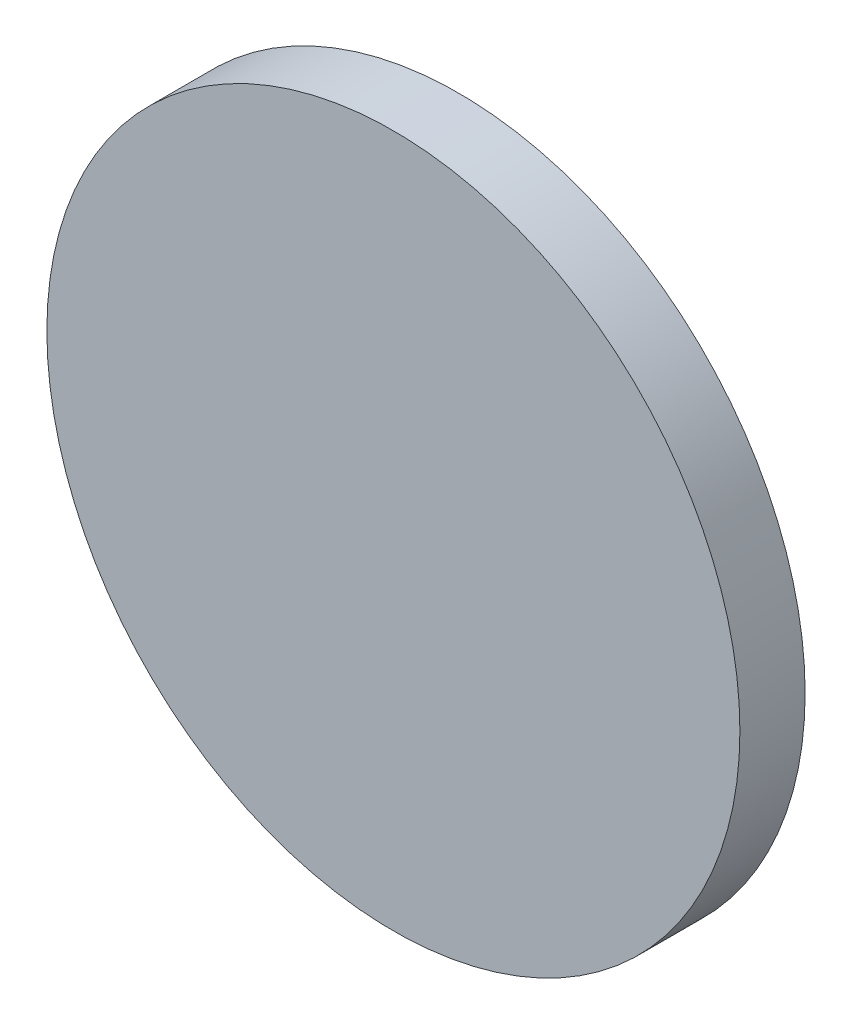
ISO-10303-21;
HEADER;
FILE_DESCRIPTION(('STEP AP214'),'2;1');
FILE_NAME('part.step','',(''),(''),'','','');
FILE_SCHEMA(('AUTOMOTIVE_DESIGN { 1 0 10303 214 1 1 1 1 }'));
ENDSEC;
DATA;
#1=APPLICATION_CONTEXT('core data for automotive mechanical design processes');
#2=APPLICATION_PROTOCOL_DEFINITION('international standard','automotive_design',2000,#1);
#3=PRODUCT_CONTEXT('',#1,'mechanical');
#4=PRODUCT('Part','Part','',(#3));
#5=PRODUCT_RELATED_PRODUCT_CATEGORY('part','',(#4));
#6=PRODUCT_DEFINITION_FORMATION('','',#4);
#7=PRODUCT_DEFINITION_CONTEXT('part definition',#1,'design');
#8=PRODUCT_DEFINITION('design','',#6,#7);
#9=PRODUCT_DEFINITION_SHAPE('','',#8);
#10=(LENGTH_UNIT() NAMED_UNIT(*) SI_UNIT(.MILLI.,.METRE.));
#11=(NAMED_UNIT(*) PLANE_ANGLE_UNIT() SI_UNIT($,.RADIAN.));
#12=(NAMED_UNIT(*) SI_UNIT($,.STERADIAN.) SOLID_ANGLE_UNIT());
#13=UNCERTAINTY_MEASURE_WITH_UNIT(LENGTH_MEASURE(1.E-05),#10,'distance_accuracy_value','');
#14=(GEOMETRIC_REPRESENTATION_CONTEXT(3) GLOBAL_UNCERTAINTY_ASSIGNED_CONTEXT((#13)) GLOBAL_UNIT_ASSIGNED_CONTEXT((#10,
#11,#12)) REPRESENTATION_CONTEXT('',''));
#15=CARTESIAN_POINT('',(0.,0.,0.));
#16=DIRECTION('',(0.,0.,1.));
#17=DIRECTION('',(1.,0.,0.));
#18=AXIS2_PLACEMENT_3D('',#15,#16,#17);
#19=CARTESIAN_POINT('',(0.,0.,24.));
#20=DIRECTION('',(0.,0.,-1.));
#21=DIRECTION('',(-1.,0.,0.));
#22=AXIS2_PLACEMENT_3D('',#19,#20,#21);
#23=CYLINDRICAL_SURFACE('',#22,127.5);
#24=CARTESIAN_POINT('',(0.,0.,24.));
#25=DIRECTION('',(0.,0.,-1.));
#26=DIRECTION('',(1.,0.,0.));
#27=AXIS2_PLACEMENT_3D('',#24,#25,#26);
#28=CIRCLE('',#27,127.5);
#29=CARTESIAN_POINT('',(127.5,0.,24.));
#30=VERTEX_POINT('',#29);
#31=EDGE_CURVE('E10',#30,#30,#28,.T.);
#32=ORIENTED_EDGE('',*,*,#31,.T.);
#33=EDGE_LOOP('',(#32));
#34=FACE_BOUND('',#33,.T.);
#35=CARTESIAN_POINT('',(0.,0.,0.));
#36=DIRECTION('',(0.,0.,-1.));
#37=DIRECTION('',(1.,0.,0.));
#38=AXIS2_PLACEMENT_3D('',#35,#36,#37);
#39=CIRCLE('',#38,127.5);
#40=CARTESIAN_POINT('',(127.5,0.,0.));
#41=VERTEX_POINT('',#40);
#42=EDGE_CURVE('E18',#41,#41,#39,.T.);
#43=ORIENTED_EDGE('',*,*,#42,.F.);
#44=EDGE_LOOP('',(#43));
#45=FACE_BOUND('',#44,.T.);
#46=ADVANCED_FACE('F15',(#34,#45),#23,.T.);
#47=CARTESIAN_POINT('',(0.,0.,24.));
#48=DIRECTION('',(0.,0.,-1.));
#49=DIRECTION('',(-1.,0.,0.));
#50=AXIS2_PLACEMENT_3D('',#47,#48,#49);
#51=PLANE('',#50);
#52=ORIENTED_EDGE('',*,*,#31,.F.);
#53=EDGE_LOOP('',(#52));
#54=FACE_BOUND('',#53,.T.);
#55=ADVANCED_FACE('F33',(#54),#51,.F.);
#56=CARTESIAN_POINT('',(0.,0.,0.));
#57=DIRECTION('',(0.,0.,-1.));
#58=DIRECTION('',(-1.,0.,0.));
#59=AXIS2_PLACEMENT_3D('',#56,#57,#58);
#60=PLANE('',#59);
#61=ORIENTED_EDGE('',*,*,#42,.T.);
#62=EDGE_LOOP('',(#61));
#63=FACE_BOUND('',#62,.T.);
#64=ADVANCED_FACE('F30',(#63),#60,.T.);
#65=CLOSED_SHELL('',(#46,#55,#64));
#66=MANIFOLD_SOLID_BREP('B1',#65);
#67=ADVANCED_BREP_SHAPE_REPRESENTATION('',(#18,#66),#14);
#68=SHAPE_DEFINITION_REPRESENTATION(#9,#67);
ENDSEC;
END-ISO-10303-21;
